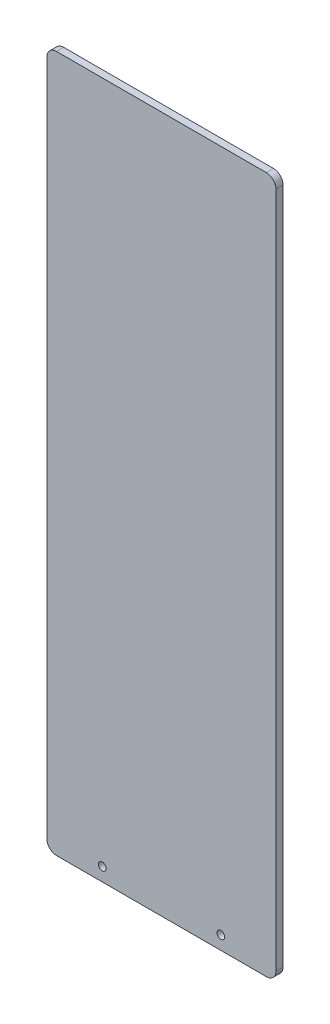
ISO-10303-21;
HEADER;
FILE_DESCRIPTION(('STEP AP214'),'2;1');
FILE_NAME('part.step','',(''),(''),'','','');
FILE_SCHEMA(('AUTOMOTIVE_DESIGN { 1 0 10303 214 1 1 1 1 }'));
ENDSEC;
DATA;
#1=APPLICATION_CONTEXT('core data for automotive mechanical design processes');
#2=APPLICATION_PROTOCOL_DEFINITION('international standard','automotive_design',2000,#1);
#3=PRODUCT_CONTEXT('',#1,'mechanical');
#4=PRODUCT('Part','Part','',(#3));
#5=PRODUCT_RELATED_PRODUCT_CATEGORY('part','',(#4));
#6=PRODUCT_DEFINITION_FORMATION('','',#4);
#7=PRODUCT_DEFINITION_CONTEXT('part definition',#1,'design');
#8=PRODUCT_DEFINITION('design','',#6,#7);
#9=PRODUCT_DEFINITION_SHAPE('','',#8);
#10=(LENGTH_UNIT() NAMED_UNIT(*) SI_UNIT(.MILLI.,.METRE.));
#11=(NAMED_UNIT(*) PLANE_ANGLE_UNIT() SI_UNIT($,.RADIAN.));
#12=(NAMED_UNIT(*) SI_UNIT($,.STERADIAN.) SOLID_ANGLE_UNIT());
#13=UNCERTAINTY_MEASURE_WITH_UNIT(LENGTH_MEASURE(1.E-05),#10,'distance_accuracy_value','');
#14=(GEOMETRIC_REPRESENTATION_CONTEXT(3) GLOBAL_UNCERTAINTY_ASSIGNED_CONTEXT((#13)) GLOBAL_UNIT_ASSIGNED_CONTEXT((#10,
#11,#12)) REPRESENTATION_CONTEXT('',''));
#15=CARTESIAN_POINT('',(0.,0.,0.));
#16=DIRECTION('',(0.,0.,1.));
#17=DIRECTION('',(1.,0.,0.));
#18=AXIS2_PLACEMENT_3D('',#15,#16,#17);
#19=CARTESIAN_POINT('',(0.,0.,4.7625));
#20=DIRECTION('',(1.,0.,0.));
#21=DIRECTION('',(0.,0.,-1.));
#22=AXIS2_PLACEMENT_3D('',#19,#20,#21);
#23=PLANE('',#22);
#24=DIRECTION('',(0.,-1.,0.));
#25=VECTOR('',#24,1.);
#26=CARTESIAN_POINT('',(0.,0.,0.));
#27=LINE('',#26,#25);
#28=CARTESIAN_POINT('',(0.,457.2,0.));
#29=VERTEX_POINT('',#28);
#30=CARTESIAN_POINT('',(0.,6.35,0.));
#31=VERTEX_POINT('',#30);
#32=EDGE_CURVE('E127',#29,#31,#27,.T.);
#33=ORIENTED_EDGE('',*,*,#32,.T.);
#34=DIRECTION('',(0.,0.,-1.));
#35=VECTOR('',#34,1.);
#36=CARTESIAN_POINT('',(0.,6.35,4.7625));
#37=LINE('',#36,#35);
#38=CARTESIAN_POINT('',(0.,6.35,4.7625));
#39=VERTEX_POINT('',#38);
#40=EDGE_CURVE('E105',#31,#39,#37,.F.);
#41=ORIENTED_EDGE('',*,*,#40,.T.);
#42=DIRECTION('',(0.,-1.,0.));
#43=VECTOR('',#42,1.);
#44=CARTESIAN_POINT('',(0.,0.,4.7625));
#45=LINE('',#44,#43);
#46=CARTESIAN_POINT('',(0.,457.2,4.7625));
#47=VERTEX_POINT('',#46);
#48=EDGE_CURVE('E137',#47,#39,#45,.T.);
#49=ORIENTED_EDGE('',*,*,#48,.F.);
#50=DIRECTION('',(0.,0.,-1.));
#51=VECTOR('',#50,1.);
#52=CARTESIAN_POINT('',(0.,457.2,4.7625));
#53=LINE('',#52,#51);
#54=EDGE_CURVE('E110',#47,#29,#53,.T.);
#55=ORIENTED_EDGE('',*,*,#54,.T.);
#56=EDGE_LOOP('',(#33,#41,#49,#55));
#57=FACE_BOUND('',#56,.T.);
#58=ADVANCED_FACE('F33',(#57),#23,.F.);
#59=CARTESIAN_POINT('',(0.,0.,4.7625));
#60=DIRECTION('',(0.,1.,0.));
#61=DIRECTION('',(0.,0.,1.));
#62=AXIS2_PLACEMENT_3D('',#59,#60,#61);
#63=PLANE('',#62);
#64=DIRECTION('',(1.,0.,0.));
#65=VECTOR('',#64,1.);
#66=CARTESIAN_POINT('',(0.,0.,4.7625));
#67=LINE('',#66,#65);
#68=CARTESIAN_POINT('',(6.35,0.,4.7625));
#69=VERTEX_POINT('',#68);
#70=CARTESIAN_POINT('',(146.05,0.,4.7625));
#71=VERTEX_POINT('',#70);
#72=EDGE_CURVE('E120',#69,#71,#67,.T.);
#73=ORIENTED_EDGE('',*,*,#72,.F.);
#74=DIRECTION('',(0.,0.,-1.));
#75=VECTOR('',#74,1.);
#76=CARTESIAN_POINT('',(6.35,0.,4.7625));
#77=LINE('',#76,#75);
#78=CARTESIAN_POINT('',(6.35,0.,0.));
#79=VERTEX_POINT('',#78);
#80=EDGE_CURVE('E104',#69,#79,#77,.T.);
#81=ORIENTED_EDGE('',*,*,#80,.T.);
#82=DIRECTION('',(1.,0.,0.));
#83=VECTOR('',#82,1.);
#84=CARTESIAN_POINT('',(0.,0.,0.));
#85=LINE('',#84,#83);
#86=CARTESIAN_POINT('',(146.05,0.,0.));
#87=VERTEX_POINT('',#86);
#88=EDGE_CURVE('E117',#79,#87,#85,.T.);
#89=ORIENTED_EDGE('',*,*,#88,.T.);
#90=DIRECTION('',(0.,0.,-1.));
#91=VECTOR('',#90,1.);
#92=CARTESIAN_POINT('',(146.05,0.,4.7625));
#93=LINE('',#92,#91);
#94=EDGE_CURVE('E122',#87,#71,#93,.F.);
#95=ORIENTED_EDGE('',*,*,#94,.T.);
#96=EDGE_LOOP('',(#73,#81,#89,#95));
#97=FACE_BOUND('',#96,.T.);
#98=ADVANCED_FACE('F116',(#97),#63,.F.);
#99=CARTESIAN_POINT('',(152.4,0.,4.7625));
#100=DIRECTION('',(-1.,0.,0.));
#101=DIRECTION('',(0.,0.,1.));
#102=AXIS2_PLACEMENT_3D('',#99,#100,#101);
#103=PLANE('',#102);
#104=DIRECTION('',(0.,1.,0.));
#105=VECTOR('',#104,1.);
#106=CARTESIAN_POINT('',(152.4,0.,4.7625));
#107=LINE('',#106,#105);
#108=CARTESIAN_POINT('',(152.4,6.35,4.7625));
#109=VERTEX_POINT('',#108);
#110=CARTESIAN_POINT('',(152.4,457.2,4.7625));
#111=VERTEX_POINT('',#110);
#112=EDGE_CURVE('E175',#109,#111,#107,.T.);
#113=ORIENTED_EDGE('',*,*,#112,.F.);
#114=DIRECTION('',(0.,0.,-1.));
#115=VECTOR('',#114,1.);
#116=CARTESIAN_POINT('',(152.4,6.35,4.7625));
#117=LINE('',#116,#115);
#118=CARTESIAN_POINT('',(152.4,6.35,0.));
#119=VERTEX_POINT('',#118);
#120=EDGE_CURVE('E156',#109,#119,#117,.T.);
#121=ORIENTED_EDGE('',*,*,#120,.T.);
#122=DIRECTION('',(0.,1.,0.));
#123=VECTOR('',#122,1.);
#124=CARTESIAN_POINT('',(152.4,0.,0.));
#125=LINE('',#124,#123);
#126=CARTESIAN_POINT('',(152.4,457.2,0.));
#127=VERTEX_POINT('',#126);
#128=EDGE_CURVE('E126',#119,#127,#125,.T.);
#129=ORIENTED_EDGE('',*,*,#128,.T.);
#130=DIRECTION('',(0.,0.,-1.));
#131=VECTOR('',#130,1.);
#132=CARTESIAN_POINT('',(152.4,457.2,4.7625));
#133=LINE('',#132,#131);
#134=EDGE_CURVE('E154',#127,#111,#133,.F.);
#135=ORIENTED_EDGE('',*,*,#134,.T.);
#136=EDGE_LOOP('',(#113,#121,#129,#135));
#137=FACE_BOUND('',#136,.T.);
#138=ADVANCED_FACE('F190',(#137),#103,.F.);
#139=CARTESIAN_POINT('',(0.,463.55,4.7625));
#140=DIRECTION('',(0.,-1.,0.));
#141=DIRECTION('',(0.,0.,-1.));
#142=AXIS2_PLACEMENT_3D('',#139,#140,#141);
#143=PLANE('',#142);
#144=DIRECTION('',(-1.,0.,0.));
#145=VECTOR('',#144,1.);
#146=CARTESIAN_POINT('',(0.,463.55,0.));
#147=LINE('',#146,#145);
#148=CARTESIAN_POINT('',(146.05,463.55,0.));
#149=VERTEX_POINT('',#148);
#150=CARTESIAN_POINT('',(6.35,463.55,0.));
#151=VERTEX_POINT('',#150);
#152=EDGE_CURVE('E130',#149,#151,#147,.T.);
#153=ORIENTED_EDGE('',*,*,#152,.T.);
#154=DIRECTION('',(0.,0.,-1.));
#155=VECTOR('',#154,1.);
#156=CARTESIAN_POINT('',(6.35,463.55,4.7625));
#157=LINE('',#156,#155);
#158=CARTESIAN_POINT('',(6.35,463.55,4.7625));
#159=VERTEX_POINT('',#158);
#160=EDGE_CURVE('E11',#151,#159,#157,.F.);
#161=ORIENTED_EDGE('',*,*,#160,.T.);
#162=DIRECTION('',(-1.,0.,0.));
#163=VECTOR('',#162,1.);
#164=CARTESIAN_POINT('',(0.,463.55,4.7625));
#165=LINE('',#164,#163);
#166=CARTESIAN_POINT('',(146.05,463.55,4.7625));
#167=VERTEX_POINT('',#166);
#168=EDGE_CURVE('E138',#167,#159,#165,.T.);
#169=ORIENTED_EDGE('',*,*,#168,.F.);
#170=DIRECTION('',(0.,0.,-1.));
#171=VECTOR('',#170,1.);
#172=CARTESIAN_POINT('',(146.05,463.55,4.7625));
#173=LINE('',#172,#171);
#174=EDGE_CURVE('E42',#167,#149,#173,.T.);
#175=ORIENTED_EDGE('',*,*,#174,.T.);
#176=EDGE_LOOP('',(#153,#161,#169,#175));
#177=FACE_BOUND('',#176,.T.);
#178=ADVANCED_FACE('F185',(#177),#143,.F.);
#179=CARTESIAN_POINT('',(0.,0.,4.7625));
#180=DIRECTION('',(0.,0.,-1.));
#181=DIRECTION('',(-1.,0.,0.));
#182=AXIS2_PLACEMENT_3D('',#179,#180,#181);
#183=PLANE('',#182);
#184=CARTESIAN_POINT('',(115.732888619932,8.95350000000001,4.7625));
#185=DIRECTION('',(0.,0.,1.));
#186=DIRECTION('',(1.,0.,0.));
#187=AXIS2_PLACEMENT_3D('',#184,#185,#186);
#188=CIRCLE('',#187,2.54);
#189=CARTESIAN_POINT('',(118.272888619932,8.95350000000001,4.7625));
#190=VERTEX_POINT('',#189);
#191=EDGE_CURVE('E169',#190,#190,#188,.T.);
#192=ORIENTED_EDGE('',*,*,#191,.F.);
#193=EDGE_LOOP('',(#192));
#194=FACE_BOUND('',#193,.T.);
#195=CARTESIAN_POINT('',(36.83,8.95350000000001,4.7625));
#196=DIRECTION('',(0.,0.,1.));
#197=DIRECTION('',(1.,0.,0.));
#198=AXIS2_PLACEMENT_3D('',#195,#196,#197);
#199=CIRCLE('',#198,2.54);
#200=CARTESIAN_POINT('',(39.37,8.95350000000001,4.7625));
#201=VERTEX_POINT('',#200);
#202=EDGE_CURVE('E161',#201,#201,#199,.T.);
#203=ORIENTED_EDGE('',*,*,#202,.F.);
#204=EDGE_LOOP('',(#203));
#205=FACE_BOUND('',#204,.T.);
#206=ORIENTED_EDGE('',*,*,#48,.T.);
#207=CARTESIAN_POINT('',(6.35,6.35,4.7625));
#208=DIRECTION('',(0.,0.,-1.));
#209=DIRECTION('',(-1.,0.,0.));
#210=AXIS2_PLACEMENT_3D('',#207,#208,#209);
#211=CIRCLE('',#210,6.35);
#212=EDGE_CURVE('E152',#39,#69,#211,.F.);
#213=ORIENTED_EDGE('',*,*,#212,.T.);
#214=ORIENTED_EDGE('',*,*,#72,.T.);
#215=CARTESIAN_POINT('',(146.05,6.35,4.7625));
#216=DIRECTION('',(0.,0.,-1.));
#217=DIRECTION('',(-1.,0.,0.));
#218=AXIS2_PLACEMENT_3D('',#215,#216,#217);
#219=CIRCLE('',#218,6.35);
#220=EDGE_CURVE('E150',#71,#109,#219,.F.);
#221=ORIENTED_EDGE('',*,*,#220,.T.);
#222=ORIENTED_EDGE('',*,*,#112,.T.);
#223=CARTESIAN_POINT('',(146.05,457.2,4.7625));
#224=DIRECTION('',(0.,0.,-1.));
#225=DIRECTION('',(-1.,0.,0.));
#226=AXIS2_PLACEMENT_3D('',#223,#224,#225);
#227=CIRCLE('',#226,6.35);
#228=EDGE_CURVE('E55',#111,#167,#227,.F.);
#229=ORIENTED_EDGE('',*,*,#228,.T.);
#230=ORIENTED_EDGE('',*,*,#168,.T.);
#231=CARTESIAN_POINT('',(6.35,457.2,4.7625));
#232=DIRECTION('',(0.,0.,-1.));
#233=DIRECTION('',(-1.,0.,0.));
#234=AXIS2_PLACEMENT_3D('',#231,#232,#233);
#235=CIRCLE('',#234,6.35);
#236=EDGE_CURVE('E148',#159,#47,#235,.F.);
#237=ORIENTED_EDGE('',*,*,#236,.T.);
#238=EDGE_LOOP('',(#206,#213,#214,#221,#222,#229,#230,#237));
#239=FACE_BOUND('',#238,.T.);
#240=ADVANCED_FACE('F177',(#194,#205,#239),#183,.F.);
#241=CARTESIAN_POINT('',(0.,0.,0.));
#242=DIRECTION('',(0.,0.,-1.));
#243=DIRECTION('',(-1.,0.,0.));
#244=AXIS2_PLACEMENT_3D('',#241,#242,#243);
#245=PLANE('',#244);
#246=CARTESIAN_POINT('',(115.732888619932,8.95350000000001,0.));
#247=DIRECTION('',(0.,0.,-1.));
#248=DIRECTION('',(-1.,0.,0.));
#249=AXIS2_PLACEMENT_3D('',#246,#247,#248);
#250=CIRCLE('',#249,2.54);
#251=CARTESIAN_POINT('',(113.192888619931,8.95350000000001,0.));
#252=VERTEX_POINT('',#251);
#253=EDGE_CURVE('E37',#252,#252,#250,.T.);
#254=ORIENTED_EDGE('',*,*,#253,.F.);
#255=EDGE_LOOP('',(#254));
#256=FACE_BOUND('',#255,.T.);
#257=CARTESIAN_POINT('',(36.83,8.95350000000001,0.));
#258=DIRECTION('',(0.,0.,-1.));
#259=DIRECTION('',(-1.,0.,0.));
#260=AXIS2_PLACEMENT_3D('',#257,#258,#259);
#261=CIRCLE('',#260,2.54);
#262=CARTESIAN_POINT('',(34.29,8.95350000000001,0.));
#263=VERTEX_POINT('',#262);
#264=EDGE_CURVE('E132',#263,#263,#261,.T.);
#265=ORIENTED_EDGE('',*,*,#264,.F.);
#266=EDGE_LOOP('',(#265));
#267=FACE_BOUND('',#266,.T.);
#268=ORIENTED_EDGE('',*,*,#88,.F.);
#269=CARTESIAN_POINT('',(6.35,6.35,0.));
#270=DIRECTION('',(0.,0.,-1.));
#271=DIRECTION('',(-1.,0.,0.));
#272=AXIS2_PLACEMENT_3D('',#269,#270,#271);
#273=CIRCLE('',#272,6.35);
#274=EDGE_CURVE('E100',#79,#31,#273,.T.);
#275=ORIENTED_EDGE('',*,*,#274,.T.);
#276=ORIENTED_EDGE('',*,*,#32,.F.);
#277=CARTESIAN_POINT('',(6.35,457.2,0.));
#278=DIRECTION('',(0.,0.,-1.));
#279=DIRECTION('',(-1.,0.,0.));
#280=AXIS2_PLACEMENT_3D('',#277,#278,#279);
#281=CIRCLE('',#280,6.35);
#282=EDGE_CURVE('E141',#29,#151,#281,.T.);
#283=ORIENTED_EDGE('',*,*,#282,.T.);
#284=ORIENTED_EDGE('',*,*,#152,.F.);
#285=CARTESIAN_POINT('',(146.05,457.2,0.));
#286=DIRECTION('',(0.,0.,-1.));
#287=DIRECTION('',(-1.,0.,0.));
#288=AXIS2_PLACEMENT_3D('',#285,#286,#287);
#289=CIRCLE('',#288,6.35);
#290=EDGE_CURVE('E121',#149,#127,#289,.T.);
#291=ORIENTED_EDGE('',*,*,#290,.T.);
#292=ORIENTED_EDGE('',*,*,#128,.F.);
#293=CARTESIAN_POINT('',(146.05,6.35,0.));
#294=DIRECTION('',(0.,0.,-1.));
#295=DIRECTION('',(-1.,0.,0.));
#296=AXIS2_PLACEMENT_3D('',#293,#294,#295);
#297=CIRCLE('',#296,6.35);
#298=EDGE_CURVE('E111',#119,#87,#297,.T.);
#299=ORIENTED_EDGE('',*,*,#298,.T.);
#300=EDGE_LOOP('',(#268,#275,#276,#283,#284,#291,#292,#299));
#301=FACE_BOUND('',#300,.T.);
#302=ADVANCED_FACE('F124',(#256,#267,#301),#245,.T.);
#303=CARTESIAN_POINT('',(6.35,6.35,4.7625));
#304=DIRECTION('',(0.,0.,-1.));
#305=DIRECTION('',(-1.,0.,0.));
#306=AXIS2_PLACEMENT_3D('',#303,#304,#305);
#307=CYLINDRICAL_SURFACE('',#306,6.35);
#308=ORIENTED_EDGE('',*,*,#212,.F.);
#309=ORIENTED_EDGE('',*,*,#40,.F.);
#310=ORIENTED_EDGE('',*,*,#274,.F.);
#311=ORIENTED_EDGE('',*,*,#80,.F.);
#312=EDGE_LOOP('',(#308,#309,#310,#311));
#313=FACE_BOUND('',#312,.T.);
#314=ADVANCED_FACE('F103',(#313),#307,.T.);
#315=CARTESIAN_POINT('',(146.05,6.35,4.7625));
#316=DIRECTION('',(0.,0.,-1.));
#317=DIRECTION('',(-1.,0.,0.));
#318=AXIS2_PLACEMENT_3D('',#315,#316,#317);
#319=CYLINDRICAL_SURFACE('',#318,6.35);
#320=ORIENTED_EDGE('',*,*,#220,.F.);
#321=ORIENTED_EDGE('',*,*,#94,.F.);
#322=ORIENTED_EDGE('',*,*,#298,.F.);
#323=ORIENTED_EDGE('',*,*,#120,.F.);
#324=EDGE_LOOP('',(#320,#321,#322,#323));
#325=FACE_BOUND('',#324,.T.);
#326=ADVANCED_FACE('F194',(#325),#319,.T.);
#327=CARTESIAN_POINT('',(6.35,457.2,4.7625));
#328=DIRECTION('',(0.,0.,-1.));
#329=DIRECTION('',(-1.,0.,0.));
#330=AXIS2_PLACEMENT_3D('',#327,#328,#329);
#331=CYLINDRICAL_SURFACE('',#330,6.35);
#332=ORIENTED_EDGE('',*,*,#236,.F.);
#333=ORIENTED_EDGE('',*,*,#160,.F.);
#334=ORIENTED_EDGE('',*,*,#282,.F.);
#335=ORIENTED_EDGE('',*,*,#54,.F.);
#336=EDGE_LOOP('',(#332,#333,#334,#335));
#337=FACE_BOUND('',#336,.T.);
#338=ADVANCED_FACE('F182',(#337),#331,.T.);
#339=CARTESIAN_POINT('',(146.05,457.2,4.7625));
#340=DIRECTION('',(0.,0.,-1.));
#341=DIRECTION('',(-1.,0.,0.));
#342=AXIS2_PLACEMENT_3D('',#339,#340,#341);
#343=CYLINDRICAL_SURFACE('',#342,6.35);
#344=ORIENTED_EDGE('',*,*,#228,.F.);
#345=ORIENTED_EDGE('',*,*,#134,.F.);
#346=ORIENTED_EDGE('',*,*,#290,.F.);
#347=ORIENTED_EDGE('',*,*,#174,.F.);
#348=EDGE_LOOP('',(#344,#345,#346,#347));
#349=FACE_BOUND('',#348,.T.);
#350=ADVANCED_FACE('F35',(#349),#343,.T.);
#351=CARTESIAN_POINT('',(36.83,8.95350000000001,-2.8575));
#352=DIRECTION('',(0.,0.,1.));
#353=DIRECTION('',(1.,0.,0.));
#354=AXIS2_PLACEMENT_3D('',#351,#352,#353);
#355=CYLINDRICAL_SURFACE('',#354,2.54);
#356=ORIENTED_EDGE('',*,*,#264,.T.);
#357=EDGE_LOOP('',(#356));
#358=FACE_BOUND('',#357,.T.);
#359=ORIENTED_EDGE('',*,*,#202,.T.);
#360=EDGE_LOOP('',(#359));
#361=FACE_BOUND('',#360,.T.);
#362=ADVANCED_FACE('F219',(#358,#361),#355,.F.);
#363=CARTESIAN_POINT('',(115.732888619932,8.95350000000001,-2.8575));
#364=DIRECTION('',(0.,0.,1.));
#365=DIRECTION('',(1.,0.,0.));
#366=AXIS2_PLACEMENT_3D('',#363,#364,#365);
#367=CYLINDRICAL_SURFACE('',#366,2.54);
#368=ORIENTED_EDGE('',*,*,#253,.T.);
#369=EDGE_LOOP('',(#368));
#370=FACE_BOUND('',#369,.T.);
#371=ORIENTED_EDGE('',*,*,#191,.T.);
#372=EDGE_LOOP('',(#371));
#373=FACE_BOUND('',#372,.T.);
#374=ADVANCED_FACE('F222',(#370,#373),#367,.F.);
#375=CLOSED_SHELL('',(#58,#98,#138,#178,#240,#302,#314,#326,#338,#350,#362,#374));
#376=MANIFOLD_SOLID_BREP('B2',#375);
#377=ADVANCED_BREP_SHAPE_REPRESENTATION('',(#18,#376),#14);
#378=SHAPE_DEFINITION_REPRESENTATION(#9,#377);
ENDSEC;
END-ISO-10303-21;
